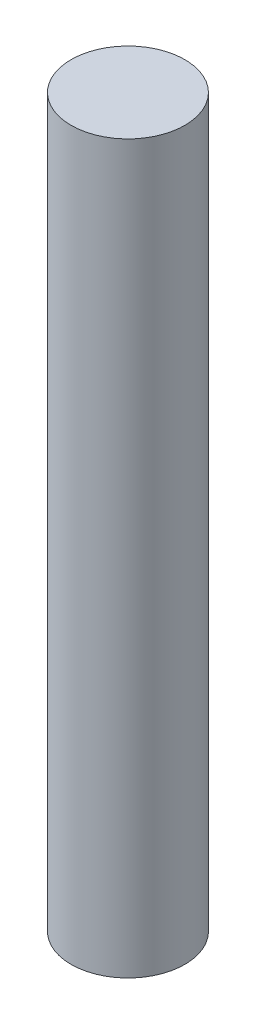
ISO-10303-21;
HEADER;
FILE_DESCRIPTION(('STEP AP214'),'2;1');
FILE_NAME('part.step','',(''),(''),'','','');
FILE_SCHEMA(('AUTOMOTIVE_DESIGN { 1 0 10303 214 1 1 1 1 }'));
ENDSEC;
DATA;
#1=APPLICATION_CONTEXT('core data for automotive mechanical design processes');
#2=APPLICATION_PROTOCOL_DEFINITION('international standard','automotive_design',2000,#1);
#3=PRODUCT_CONTEXT('',#1,'mechanical');
#4=PRODUCT('Part','Part','',(#3));
#5=PRODUCT_RELATED_PRODUCT_CATEGORY('part','',(#4));
#6=PRODUCT_DEFINITION_FORMATION('','',#4);
#7=PRODUCT_DEFINITION_CONTEXT('part definition',#1,'design');
#8=PRODUCT_DEFINITION('design','',#6,#7);
#9=PRODUCT_DEFINITION_SHAPE('','',#8);
#10=(LENGTH_UNIT() NAMED_UNIT(*) SI_UNIT(.MILLI.,.METRE.));
#11=(NAMED_UNIT(*) PLANE_ANGLE_UNIT() SI_UNIT($,.RADIAN.));
#12=(NAMED_UNIT(*) SI_UNIT($,.STERADIAN.) SOLID_ANGLE_UNIT());
#13=UNCERTAINTY_MEASURE_WITH_UNIT(LENGTH_MEASURE(1.E-05),#10,'distance_accuracy_value','');
#14=(GEOMETRIC_REPRESENTATION_CONTEXT(3) GLOBAL_UNCERTAINTY_ASSIGNED_CONTEXT((#13)) GLOBAL_UNIT_ASSIGNED_CONTEXT((#10,
#11,#12)) REPRESENTATION_CONTEXT('',''));
#15=CARTESIAN_POINT('',(0.,0.,0.));
#16=DIRECTION('',(0.,0.,1.));
#17=DIRECTION('',(1.,0.,0.));
#18=AXIS2_PLACEMENT_3D('',#15,#16,#17);
#19=CARTESIAN_POINT('',(0.,6.,0.));
#20=DIRECTION('',(0.,-1.,0.));
#21=DIRECTION('',(0.,0.,-1.));
#22=AXIS2_PLACEMENT_3D('',#19,#20,#21);
#23=CYLINDRICAL_SURFACE('',#22,0.47);
#24=CARTESIAN_POINT('',(0.,6.,0.));
#25=DIRECTION('',(0.,1.,0.));
#26=DIRECTION('',(0.,0.,1.));
#27=AXIS2_PLACEMENT_3D('',#24,#25,#26);
#28=CIRCLE('',#27,0.47);
#29=CARTESIAN_POINT('',(0.,6.,0.47));
#30=VERTEX_POINT('',#29);
#31=EDGE_CURVE('E10',#30,#30,#28,.T.);
#32=ORIENTED_EDGE('',*,*,#31,.F.);
#33=EDGE_LOOP('',(#32));
#34=FACE_BOUND('',#33,.T.);
#35=CARTESIAN_POINT('',(0.,0.,0.));
#36=DIRECTION('',(0.,1.,0.));
#37=DIRECTION('',(0.,0.,1.));
#38=AXIS2_PLACEMENT_3D('',#35,#36,#37);
#39=CIRCLE('',#38,0.47);
#40=CARTESIAN_POINT('',(0.,0.,0.47));
#41=VERTEX_POINT('',#40);
#42=EDGE_CURVE('E40',#41,#41,#39,.T.);
#43=ORIENTED_EDGE('',*,*,#42,.T.);
#44=EDGE_LOOP('',(#43));
#45=FACE_BOUND('',#44,.T.);
#46=ADVANCED_FACE('F37',(#34,#45),#23,.T.);
#47=CARTESIAN_POINT('',(0.,6.,0.));
#48=DIRECTION('',(0.,1.,0.));
#49=DIRECTION('',(0.,0.,1.));
#50=AXIS2_PLACEMENT_3D('',#47,#48,#49);
#51=PLANE('',#50);
#52=ORIENTED_EDGE('',*,*,#31,.T.);
#53=EDGE_LOOP('',(#52));
#54=FACE_BOUND('',#53,.T.);
#55=ADVANCED_FACE('F54',(#54),#51,.T.);
#56=CARTESIAN_POINT('',(0.,0.,0.));
#57=DIRECTION('',(0.,1.,0.));
#58=DIRECTION('',(0.,0.,1.));
#59=AXIS2_PLACEMENT_3D('',#56,#57,#58);
#60=PLANE('',#59);
#61=ORIENTED_EDGE('',*,*,#42,.F.);
#62=EDGE_LOOP('',(#61));
#63=FACE_BOUND('',#62,.T.);
#64=ADVANCED_FACE('F52',(#63),#60,.F.);
#65=CLOSED_SHELL('',(#46,#55,#64));
#66=MANIFOLD_SOLID_BREP('B2',#65);
#67=ADVANCED_BREP_SHAPE_REPRESENTATION('',(#18,#66),#14);
#68=SHAPE_DEFINITION_REPRESENTATION(#9,#67);
ENDSEC;
END-ISO-10303-21;
